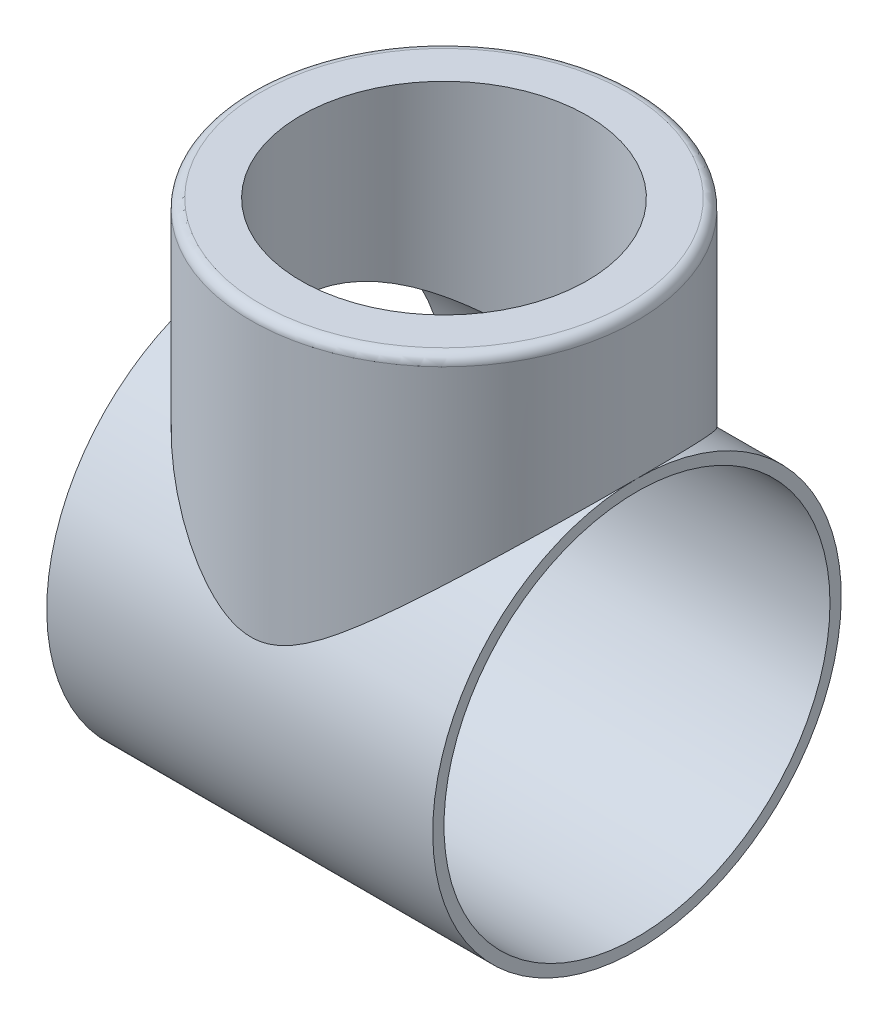
ISO-10303-21;
HEADER;
FILE_DESCRIPTION(('STEP AP214'),'2;1');
FILE_NAME('part.step','',(''),(''),'','','');
FILE_SCHEMA(('AUTOMOTIVE_DESIGN { 1 0 10303 214 1 1 1 1 }'));
ENDSEC;
DATA;
#1=APPLICATION_CONTEXT('core data for automotive mechanical design processes');
#2=APPLICATION_PROTOCOL_DEFINITION('international standard','automotive_design',2000,#1);
#3=PRODUCT_CONTEXT('',#1,'mechanical');
#4=PRODUCT('Part','Part','',(#3));
#5=PRODUCT_RELATED_PRODUCT_CATEGORY('part','',(#4));
#6=PRODUCT_DEFINITION_FORMATION('','',#4);
#7=PRODUCT_DEFINITION_CONTEXT('part definition',#1,'design');
#8=PRODUCT_DEFINITION('design','',#6,#7);
#9=PRODUCT_DEFINITION_SHAPE('','',#8);
#10=(LENGTH_UNIT() NAMED_UNIT(*) SI_UNIT(.MILLI.,.METRE.));
#11=(NAMED_UNIT(*) PLANE_ANGLE_UNIT() SI_UNIT($,.RADIAN.));
#12=(NAMED_UNIT(*) SI_UNIT($,.STERADIAN.) SOLID_ANGLE_UNIT());
#13=UNCERTAINTY_MEASURE_WITH_UNIT(LENGTH_MEASURE(1.E-05),#10,'distance_accuracy_value','');
#14=(GEOMETRIC_REPRESENTATION_CONTEXT(3) GLOBAL_UNCERTAINTY_ASSIGNED_CONTEXT((#13)) GLOBAL_UNIT_ASSIGNED_CONTEXT((#10,
#11,#12)) REPRESENTATION_CONTEXT('',''));
#15=CARTESIAN_POINT('',(0.,0.,0.));
#16=DIRECTION('',(0.,0.,1.));
#17=DIRECTION('',(1.,0.,0.));
#18=AXIS2_PLACEMENT_3D('',#15,#16,#17);
#19=CARTESIAN_POINT('',(-60.,0.,0.));
#20=DIRECTION('',(1.,0.,0.));
#21=DIRECTION('',(0.,0.,-1.));
#22=AXIS2_PLACEMENT_3D('',#19,#20,#21);
#23=CYLINDRICAL_SURFACE('',#22,60.);
#24=CARTESIAN_POINT('',(60.,0.,0.));
#25=DIRECTION('',(1.,0.,0.));
#26=DIRECTION('',(0.,0.,-1.));
#27=AXIS2_PLACEMENT_3D('',#24,#25,#26);
#28=CIRCLE('',#27,60.);
#29=CARTESIAN_POINT('',(60.,0.,-60.));
#30=VERTEX_POINT('',#29);
#31=EDGE_CURVE('E59',#30,#30,#28,.T.);
#32=ORIENTED_EDGE('',*,*,#31,.T.);
#33=EDGE_LOOP('',(#32));
#34=FACE_BOUND('',#33,.T.);
#35=CARTESIAN_POINT('',(-60.,0.,0.));
#36=DIRECTION('',(1.,0.,0.));
#37=DIRECTION('',(0.,0.,-1.));
#38=AXIS2_PLACEMENT_3D('',#35,#36,#37);
#39=CIRCLE('',#38,60.);
#40=CARTESIAN_POINT('',(-60.,0.,-60.));
#41=VERTEX_POINT('',#40);
#42=EDGE_CURVE('E100',#41,#41,#39,.T.);
#43=ORIENTED_EDGE('',*,*,#42,.F.);
#44=EDGE_LOOP('',(#43));
#45=FACE_BOUND('',#44,.T.);
#46=CARTESIAN_POINT('',(0.,40.2461178252015,-44.5));
#47=CARTESIAN_POINT('',(0.521950340710105,40.2461091874401,-44.5000042882494));
#48=CARTESIAN_POINT('',(1.04383948497891,40.2562813467974,-44.4908134860222));
#49=CARTESIAN_POINT('',(2.08624468800879,40.29679076695,-44.4541277588759));
#50=CARTESIAN_POINT('',(2.60676066855394,40.3271291525426,-44.4266318129637));
#51=CARTESIAN_POINT('',(3.64504853630487,40.4075295655595,-44.353517329002));
#52=CARTESIAN_POINT('',(4.16282007227801,40.4575940585679,-44.3078965255041));
#53=CARTESIAN_POINT('',(5.19431452475009,40.5766947814115,-44.1988491619566));
#54=CARTESIAN_POINT('',(5.70803686242041,40.6457336747779,-44.1354201020462));
#55=CARTESIAN_POINT('',(7.24359513295137,40.8802693471307,-43.9186705620038));
#56=CARTESIAN_POINT('',(8.25776608674282,41.0730198952663,-43.7390345051422));
#57=CARTESIAN_POINT('',(10.257564643931,41.5212745320888,-43.3137226483211));
#58=CARTESIAN_POINT('',(11.2431912015059,41.7767809168073,-43.068044432063));
#59=CARTESIAN_POINT('',(13.1683910438996,42.3357936145265,-42.5186066248349));
#60=CARTESIAN_POINT('',(14.1084079437203,42.6386010337178,-42.2156810096681));
#61=CARTESIAN_POINT('',(15.9539269275721,43.2842945061565,-41.5533826240879));
#62=CARTESIAN_POINT('',(16.8594298899541,43.627179538558,-41.1940112913641));
#63=CARTESIAN_POINT('',(18.6345171116782,44.3433852758225,-40.4220393745185));
#64=CARTESIAN_POINT('',(19.5041118289542,44.7166970236494,-40.009454434771));
#65=CARTESIAN_POINT('',(21.2071478906121,45.4853354810806,-39.1334121551078));
#66=CARTESIAN_POINT('',(22.0405865870086,45.8806637983028,-38.6699510978862));
#67=CARTESIAN_POINT('',(23.8366942513597,46.767617311318,-37.5948011891203));
#68=CARTESIAN_POINT('',(24.7912022086411,47.2624844601025,-36.9721303467494));
#69=CARTESIAN_POINT('',(26.6465675245206,48.261565680328,-35.6581377576236));
#70=CARTESIAN_POINT('',(27.5474205383753,48.7657805043797,-34.9668104634265));
#71=CARTESIAN_POINT('',(29.2952372557201,49.7739969690618,-33.5161235927462));
#72=CARTESIAN_POINT('',(30.1421256550589,50.2779973773472,-32.756672361943));
#73=CARTESIAN_POINT('',(31.778415864999,51.275700055055,-31.1717762181585));
#74=CARTESIAN_POINT('',(32.5678130326399,51.7694014904457,-30.346325986402));
#75=CARTESIAN_POINT('',(34.2360957924212,52.8334127397948,-28.4608944512654));
#76=CARTESIAN_POINT('',(35.1017938682631,53.3995579491807,-27.3868198685674));
#77=CARTESIAN_POINT('',(36.7388816469887,54.4896567975256,-25.1480955787368));
#78=CARTESIAN_POINT('',(37.5102508272926,55.0136012466809,-23.9834262512978));
#79=CARTESIAN_POINT('',(38.5884296851264,55.7561611927072,-22.1737546625714));
#80=CARTESIAN_POINT('',(38.9344445874246,55.996289592825,-21.5605741567996));
#81=CARTESIAN_POINT('',(39.5992657729467,56.4605628572466,-20.3137179214327));
#82=CARTESIAN_POINT('',(39.9180737273749,56.6847087031497,-19.6800434539945));
#83=CARTESIAN_POINT('',(40.5269396885394,57.1151163559301,-18.3935670488333));
#84=CARTESIAN_POINT('',(40.8170136671901,57.3213880901394,-17.7407760015974));
#85=CARTESIAN_POINT('',(41.367283893526,57.7145139820236,-16.4168180955821));
#86=CARTESIAN_POINT('',(41.6274729718284,57.9013634792897,-15.7456468750289));
#87=CARTESIAN_POINT('',(42.2160536104265,58.3257078564334,-14.1098261539199));
#88=CARTESIAN_POINT('',(42.5291096534308,58.5528683078576,-13.1368990351965));
#89=CARTESIAN_POINT('',(43.0893465453492,58.9610459401474,-11.1628943464204));
#90=CARTESIAN_POINT('',(43.336542803193,59.1420739139977,-10.1618234217544));
#91=CARTESIAN_POINT('',(43.6554372000947,59.3762755689208,-8.6440871772517));
#92=CARTESIAN_POINT('',(43.7530730054295,59.4481102596546,-8.13557560487839));
#93=CARTESIAN_POINT('',(43.9307501982228,59.5789994743003,-7.11392105689515));
#94=CARTESIAN_POINT('',(44.0107948440874,59.6380563650094,-6.60077895735988));
#95=CARTESIAN_POINT('',(44.1530120978249,59.7430847523843,-5.57062792558039));
#96=CARTESIAN_POINT('',(44.2151826797549,59.7890547657069,-5.05361856180834));
#97=CARTESIAN_POINT('',(44.3214117367221,59.8676564997752,-4.01674246446689));
#98=CARTESIAN_POINT('',(44.3654693389796,59.9002875777797,-3.49687559443048));
#99=CARTESIAN_POINT('',(44.4703501236668,59.9779923563319,-1.9318670440071));
#100=CARTESIAN_POINT('',(44.5035602840376,60.0026399674937,-0.88363602968756));
#101=CARTESIAN_POINT('',(44.4958330595716,59.9969100963708,1.21224592845824));
#102=CARTESIAN_POINT('',(44.4548959647422,59.9665328293014,2.25989687453725));
#103=CARTESIAN_POINT('',(44.2995376296408,59.8514519760434,4.34695695359885));
#104=CARTESIAN_POINT('',(44.1851013218437,59.7667372505429,5.38636435239261));
#105=CARTESIAN_POINT('',(43.8844904701222,59.5448422310987,7.44901649884121));
#106=CARTESIAN_POINT('',(43.6983163060761,59.4076622149783,8.47226133205295));
#107=CARTESIAN_POINT('',(43.2641008547636,59.0890127256266,10.4628678346911));
#108=CARTESIAN_POINT('',(43.01826041709,58.9091228962178,11.4309658277476));
#109=CARTESIAN_POINT('',(42.4650233393857,58.5063437246237,13.3401503805873));
#110=CARTESIAN_POINT('',(42.1576284675576,58.2834556176068,14.2812377153866));
#111=CARTESIAN_POINT('',(41.4846675568433,57.7985571326788,16.1320211676757));
#112=CARTESIAN_POINT('',(41.1190966396067,57.5365434740096,17.0417146448432));
#113=CARTESIAN_POINT('',(40.3333455968536,56.9776492982644,18.8260933971558));
#114=CARTESIAN_POINT('',(39.9131622370173,56.6807667162419,19.7007765948666));
#115=CARTESIAN_POINT('',(38.973005458837,56.022499557773,21.5058204330082));
#116=CARTESIAN_POINT('',(38.447145875456,55.6576115664077,22.4318370619908));
#117=CARTESIAN_POINT('',(37.3370135215526,54.8966231580356,24.2346518194598));
#118=CARTESIAN_POINT('',(36.7527371551884,54.5005208199496,25.1114469129235));
#119=CARTESIAN_POINT('',(35.5293085248845,53.6830922067384,26.8145183935474));
#120=CARTESIAN_POINT('',(34.8901161360653,53.2617475573133,27.6407570734165));
#121=CARTESIAN_POINT('',(33.5606121215878,52.4004604406604,29.2406792745826));
#122=CARTESIAN_POINT('',(32.870298061972,51.9605170883568,30.0143602901862));
#123=CARTESIAN_POINT('',(31.3024484369485,50.9818427894829,31.6532889949493));
#124=CARTESIAN_POINT('',(30.4145893453604,50.4405197225372,32.5071389666396));
#125=CARTESIAN_POINT('',(28.5731712452284,49.3520446269879,34.1370213226318));
#126=CARTESIAN_POINT('',(27.6195994067465,48.8048914778322,34.9130384375959));
#127=CARTESIAN_POINT('',(25.6486318538073,47.7171498458324,36.3855978659591));
#128=CARTESIAN_POINT('',(24.6312091197479,47.1765642592419,37.0821061775823));
#129=CARTESIAN_POINT('',(22.5342509045028,46.116418432799,38.3925212205582));
#130=CARTESIAN_POINT('',(21.4547302842137,45.5968532127562,39.006447598487));
#131=CARTESIAN_POINT('',(19.4624345702153,44.6980671169939,40.0305783513116));
#132=CARTESIAN_POINT('',(18.5609538061182,44.3119394783666,40.456726223778));
#133=CARTESIAN_POINT('',(16.7197604126817,43.572807752645,41.2517262412505));
#134=CARTESIAN_POINT('',(15.7800487337206,43.2198028428767,41.6205798094328));
#135=CARTESIAN_POINT('',(13.8656151236316,42.5581977274057,42.296847572139));
#136=CARTESIAN_POINT('',(12.8909619150813,42.249515755869,42.6043753175112));
#137=CARTESIAN_POINT('',(10.9079654832495,41.6872994375876,43.1546536827896));
#138=CARTESIAN_POINT('',(9.89963037601222,41.4337519145739,43.3974197828659));
#139=CARTESIAN_POINT('',(8.04368455823555,41.0339903275956,43.7752515698321));
#140=CARTESIAN_POINT('',(7.20084207288908,40.8765977494339,43.9219324868934));
#141=CARTESIAN_POINT('',(5.50041819802821,40.6115732475786,44.1671019477012));
#142=CARTESIAN_POINT('',(4.64283865424277,40.5039351388694,44.2655964816223));
#143=CARTESIAN_POINT('',(2.91911830773351,40.3427295547646,44.4125677286822));
#144=CARTESIAN_POINT('',(2.05298633650212,40.2891112096413,44.4610914996129));
#145=CARTESIAN_POINT('',(0.317674362643003,40.2380272726962,44.5073296836804));
#146=CARTESIAN_POINT('',(-0.55150568599144,40.2405625321182,44.505043326576));
#147=CARTESIAN_POINT('',(-2.28596227436666,40.3016700196146,44.4497135761221));
#148=CARTESIAN_POINT('',(-3.15123997960492,40.3602242255133,44.3966865068562));
#149=CARTESIAN_POINT('',(-4.87190451576451,40.5308806498048,44.240941803076));
#150=CARTESIAN_POINT('',(-5.72729134396141,40.642982882947,44.1382241548749));
#151=CARTESIAN_POINT('',(-7.4240653876941,40.9165547676885,43.8847377234221));
#152=CARTESIAN_POINT('',(-8.26543150123807,41.0780927929654,43.7339023771944));
#153=CARTESIAN_POINT('',(-9.92893795590823,41.4448438963211,43.3865023518875));
#154=CARTESIAN_POINT('',(-10.7510755777273,41.6500631108678,43.1899312473468));
#155=CARTESIAN_POINT('',(-12.6870807095658,42.1846332622747,42.6690124944642));
#156=CARTESIAN_POINT('',(-13.7908179644599,42.5312978618984,42.3246484503561));
#157=CARTESIAN_POINT('',(-15.9516144607349,43.2801948728189,41.5585305214342));
#158=CARTESIAN_POINT('',(-17.0086544471686,43.6824499289662,41.1367450758049));
#159=CARTESIAN_POINT('',(-19.0755684632273,44.527930076714,40.2200546403792));
#160=CARTESIAN_POINT('',(-20.0853647652594,44.9712193419744,39.7250343695755));
#161=CARTESIAN_POINT('',(-22.0550882608731,45.884808424398,38.6661782679115));
#162=CARTESIAN_POINT('',(-23.0150204412288,46.355105530638,38.1023493373789));
#163=CARTESIAN_POINT('',(-24.9161621372768,47.3273236161702,36.8883376618597));
#164=CARTESIAN_POINT('',(-25.8556469650214,47.8297762042605,36.2358830733489));
#165=CARTESIAN_POINT('',(-27.679910014823,48.8400529111134,34.8622472738526));
#166=CARTESIAN_POINT('',(-28.5646860737176,49.3478772413438,34.1410633481983));
#167=CARTESIAN_POINT('',(-30.2772938766035,50.358584957203,32.6318457992776));
#168=CARTESIAN_POINT('',(-31.1051561867018,50.8614708686789,31.8438485747471));
#169=CARTESIAN_POINT('',(-32.7017712726705,51.853299207555,30.2019087999941));
#170=CARTESIAN_POINT('',(-33.470525540107,52.3422419866083,29.3479679149222));
#171=CARTESIAN_POINT('',(-34.9471366600719,53.2985479551122,27.5732364539518));
#172=CARTESIAN_POINT('',(-35.6548356260329,53.7658538285782,26.6522832808933));
#173=CARTESIAN_POINT('',(-37.0025002306692,54.6688659515999,24.7472453764052));
#174=CARTESIAN_POINT('',(-37.6424632932466,55.1045709991306,23.7631582461808));
#175=CARTESIAN_POINT('',(-38.8486279933934,55.9354535238626,21.7353357344004));
#176=CARTESIAN_POINT('',(-39.4148771427242,56.3306570707044,20.6916394040002));
#177=CARTESIAN_POINT('',(-40.4677394262983,57.0723077490861,18.5482327967657));
#178=CARTESIAN_POINT('',(-40.954366559355,57.4187634497671,17.4485324110101));
#179=CARTESIAN_POINT('',(-41.7734480273411,58.0060562896384,15.3713226943041));
#180=CARTESIAN_POINT('',(-42.1180999819418,58.2549428335656,14.4008872247955));
#181=CARTESIAN_POINT('',(-42.7416054367343,58.7073143426455,12.4287679411175));
#182=CARTESIAN_POINT('',(-43.0204651989122,58.9108036285294,11.4270871111101));
#183=CARTESIAN_POINT('',(-43.5086322607101,59.2682330369469,9.39874524150024));
#184=CARTESIAN_POINT('',(-43.7179750064187,59.4221984100089,8.37209721993441));
#185=CARTESIAN_POINT('',(-44.0642873146111,59.6774471738407,6.30013580032234));
#186=CARTESIAN_POINT('',(-44.2012560659236,59.7787299741415,5.25482219320709));
#187=CARTESIAN_POINT('',(-44.4009995850255,59.9265736105224,3.14995644098688));
#188=CARTESIAN_POINT('',(-44.4635423875705,59.9729633575138,2.09037013500847));
#189=CARTESIAN_POINT('',(-44.5126410521356,60.0093737571475,-0.0315402479794816));
#190=CARTESIAN_POINT('',(-44.49919675987,59.9993942953369,-1.09386433054349));
#191=CARTESIAN_POINT('',(-44.3965384869147,59.9232964064283,-3.21290418427762));
#192=CARTESIAN_POINT('',(-44.3073172142214,59.8571725765695,-4.26961940586038));
#193=CARTESIAN_POINT('',(-44.0545293478902,59.6702967677894,-6.36918090875246));
#194=CARTESIAN_POINT('',(-43.8909640703089,59.5495457558927,-7.41202743523263));
#195=CARTESIAN_POINT('',(-43.5013980468378,59.2630163329123,-9.42773117519935));
#196=CARTESIAN_POINT('',(-43.2786998341044,59.0996258396571,-10.4015717985618));
#197=CARTESIAN_POINT('',(-42.7709367825483,58.7288085972727,-12.3241853536313));
#198=CARTESIAN_POINT('',(-42.4858743947813,58.5213835788113,-13.2729592688756));
#199=CARTESIAN_POINT('',(-41.8566393162162,58.0661784465417,-15.1407765123869));
#200=CARTESIAN_POINT('',(-41.5124612489804,57.818394662301,-16.0598171274347));
#201=CARTESIAN_POINT('',(-40.7685039846635,57.2865888952406,-17.864256334358));
#202=CARTESIAN_POINT('',(-40.3687215084379,57.0025647753105,-18.7496529382301));
#203=CARTESIAN_POINT('',(-39.4756743282588,56.373476215924,-20.5680435948418));
#204=CARTESIAN_POINT('',(-38.9771009809435,56.0251623487047,-21.4973049359076));
#205=CARTESIAN_POINT('',(-37.9216627541991,55.2960838893367,-23.3087229625223));
#206=CARTESIAN_POINT('',(-37.3647947388914,54.9153175516585,-24.1908771101481));
#207=CARTESIAN_POINT('',(-36.196421767278,54.1271171877636,-25.9065023282224));
#208=CARTESIAN_POINT('',(-35.5848840858751,53.7196672283635,-26.7399437390662));
#209=CARTESIAN_POINT('',(-34.3109233963292,52.8843847752664,-28.3561187012408));
#210=CARTESIAN_POINT('',(-33.6484978667809,52.4565512719992,-29.1388497364131));
#211=CARTESIAN_POINT('',(-32.1442957713006,51.5034469314094,-30.797337438415));
#212=CARTESIAN_POINT('',(-31.2924453848203,50.9751879296599,-31.6622617350211));
#213=CARTESIAN_POINT('',(-29.5241829089023,49.9092126334412,-33.3172559849402));
#214=CARTESIAN_POINT('',(-28.6077594512591,49.3714946862736,-34.1073126999826));
#215=CARTESIAN_POINT('',(-26.7122623392538,48.297870061859,-35.6113733885586));
#216=CARTESIAN_POINT('',(-25.7331462834457,47.7619648741604,-36.3253250006942));
#217=CARTESIAN_POINT('',(-23.7143783853228,46.7052659315094,-37.6742851619448));
#218=CARTESIAN_POINT('',(-22.6747375816564,46.184469446795,-38.3093080404504));
#219=CARTESIAN_POINT('',(-20.7074274646056,45.2539753190545,-39.4018648234355));
#220=CARTESIAN_POINT('',(-19.7885739385137,44.8398636275907,-39.8715266699809));
#221=CARTESIAN_POINT('',(-17.9091303612557,44.0427382109742,-40.7503257680393));
#222=CARTESIAN_POINT('',(-16.9485395648822,43.6597250414274,-41.1594619383084));
#223=CARTESIAN_POINT('',(-14.9886766513092,42.9369595143049,-41.9128813803387));
#224=CARTESIAN_POINT('',(-13.9894816994186,42.5971261433523,-42.2572866992272));
#225=CARTESIAN_POINT('',(-11.9533246844578,41.972544556354,-42.877728409414));
#226=CARTESIAN_POINT('',(-10.9163746735275,41.6877789416741,-43.1537864027726));
#227=CARTESIAN_POINT('',(-9.06795056486468,41.2478015067845,-43.5739296071159));
#228=CARTESIAN_POINT('',(-8.26352200117434,41.0779436302794,-43.7337772467831));
#229=CARTESIAN_POINT('',(-6.63919931287222,40.7822487862483,-44.0096492737428));
#230=CARTESIAN_POINT('',(-5.8193077359748,40.6564046325783,-44.1256808151597));
#231=CARTESIAN_POINT('',(-4.16918296146037,40.4532122182416,-44.3120376887577));
#232=CARTESIAN_POINT('',(-3.33896078214854,40.375816164653,-44.3824080671271));
#233=CARTESIAN_POINT('',(-1.6724406360641,40.2722721227382,-44.4763892223377));
#234=CARTESIAN_POINT('',(-0.836141794890599,40.2461316625205,-44.4999931304106));
#235=CARTESIAN_POINT('',(0.,40.2461178252015,-44.5));
#236=B_SPLINE_CURVE_WITH_KNOTS('',3,(#46,#47,#48,#49,#50,#51,#52,#53,#54,#55,#56,#57,#58,#59,
#60,#61,#62,#63,#64,#65,#66,#67,#68,#69,#70,#71,#72,#73,#74,#75,#76,#77,#78,#79,#80,#81,#82,#83,
#84,#85,#86,#87,#88,#89,#90,#91,#92,#93,#94,#95,#96,#97,#98,#99,#100,#101,#102,#103,#104,#105,
#106,#107,#108,#109,#110,#111,#112,#113,#114,#115,#116,#117,#118,#119,#120,#121,#122,#123,#124,
#125,#126,#127,#128,#129,#130,#131,#132,#133,#134,#135,#136,#137,#138,#139,#140,#141,#142,#143,
#144,#145,#146,#147,#148,#149,#150,#151,#152,#153,#154,#155,#156,#157,#158,#159,#160,#161,#162,
#163,#164,#165,#166,#167,#168,#169,#170,#171,#172,#173,#174,#175,#176,#177,#178,#179,#180,#181,
#182,#183,#184,#185,#186,#187,#188,#189,#190,#191,#192,#193,#194,#195,#196,#197,#198,#199,#200,
#201,#202,#203,#204,#205,#206,#207,#208,#209,#210,#211,#212,#213,#214,#215,#216,#217,#218,#219,
#220,#221,#222,#223,#224,#225,#226,#227,#228,#229,#230,#231,#232,#233,#234,#235),.UNSPECIFIED.,
.T.,.F.,(4,2,2,2,2,2,2,2,2,2,2,2,2,2,2,2,2,2,2,2,2,2,2,2,2,2,2,2,2,2,2,2,2,2,2,2,2,2,2,2,2,2,2,
2,2,2,2,2,2,2,2,2,2,2,2,2,2,2,2,2,2,2,2,2,2,2,2,2,2,2,2,2,2,2,2,2,2,2,2,2,2,2,2,2,2,2,2,2,2,2,2,
2,2,2,4),(0.,1.56556517147146,3.13121767169813,4.69706592637481,6.26313409934394,
9.40144702949159,12.5398747973961,15.6356864170503,18.7314191982175,21.826243924496,
24.9212949274269,28.6453743115329,32.3697548465043,36.099223572733,39.8289931555986,
44.2965662154786,48.7651095360273,50.9960052618935,53.2267638547709,55.4562754288435,
57.6863207501565,60.823899258746,63.9607430356961,65.5286258562801,67.0962180130722,
68.6639877792385,70.2318330800318,73.3745578864826,76.5172704010164,79.660627385307,
82.8039677245902,85.8454248664966,88.8867946525303,91.9284196070492,94.9702247782702,
98.3440535849777,101.718090195545,105.09461339013,108.471297448081,112.503760025058,
116.53701215405,120.57198268409,124.605991574121,127.81141806161,131.016764914371,
134.216120486931,137.4147106213,140.021682558505,142.62833033385,145.23252116116,
147.836751465953,150.440144230556,153.04353771224,155.650548295344,158.257925361325,
161.873592564132,165.490736979422,169.113637051068,172.736174106099,176.48094468703,
180.225863240111,183.968754575554,187.71155142972,191.463753733026,195.216098686979,
198.966012991889,202.715267292296,205.890427517031,209.065285413528,212.238521984498,
215.411794120498,218.594930785149,221.778073912902,224.961523388583,228.144916512222,
231.17841403459,234.211792354927,237.245446700401,240.279280024709,243.607858112388,
246.936615348285,250.267378683901,253.598307159686,257.566177425562,261.534747995964,
265.506031612056,269.476593191306,272.809775718956,276.14301778413,279.46991070141,
282.795750764736,285.306240089339,287.816319333457,290.323918524506,292.831885988828),.UNSPECIFIED.);
#237=CARTESIAN_POINT('',(0.,40.2461178252015,-44.5));
#238=VERTEX_POINT('',#237);
#239=EDGE_CURVE('E21',#238,#238,#236,.T.);
#240=ORIENTED_EDGE('',*,*,#239,.F.);
#241=EDGE_LOOP('',(#240));
#242=FACE_BOUND('',#241,.T.);
#243=ADVANCED_FACE('F16',(#34,#45,#242),#23,.F.);
#244=CARTESIAN_POINT('',(0.,0.,0.));
#245=DIRECTION('',(0.,-1.,0.));
#246=DIRECTION('',(0.,0.,-1.));
#247=AXIS2_PLACEMENT_3D('',#244,#245,#246);
#248=CYLINDRICAL_SURFACE('',#247,60.);
#249=CARTESIAN_POINT('',(0.,106.,0.));
#250=DIRECTION('',(0.,-1.,0.));
#251=DIRECTION('',(0.,0.,-1.));
#252=AXIS2_PLACEMENT_3D('',#249,#250,#251);
#253=CIRCLE('',#252,60.);
#254=CARTESIAN_POINT('',(0.,106.,-60.));
#255=VERTEX_POINT('',#254);
#256=EDGE_CURVE('E11',#255,#255,#253,.T.);
#257=ORIENTED_EDGE('',*,*,#256,.T.);
#258=EDGE_LOOP('',(#257));
#259=FACE_BOUND('',#258,.T.);
#260=CARTESIAN_POINT('',(0.,20.7906228862918,-60.));
#261=CARTESIAN_POINT('',(0.758528909390587,20.7906687322399,-59.9999904065511));
#262=CARTESIAN_POINT('',(1.51729366262084,20.8324790088875,-59.98554699321));
#263=CARTESIAN_POINT('',(3.02541119739763,20.9961734248151,-59.9284381571005));
#264=CARTESIAN_POINT('',(3.77475470966428,21.1181309601118,-59.8857468656814));
#265=CARTESIAN_POINT('',(5.26008636130046,21.4333476508569,-59.7736517022794));
#266=CARTESIAN_POINT('',(5.99598309437329,21.6269798770012,-59.7041079787402));
#267=CARTESIAN_POINT('',(7.44660432062503,22.0731706531462,-59.5405851678695));
#268=CARTESIAN_POINT('',(8.16132786930634,22.3257318274138,-59.4466049922948));
#269=CARTESIAN_POINT('',(9.41850242889429,22.8188288099898,-59.2587975120337));
#270=CARTESIAN_POINT('',(9.96516431764428,23.0504265040595,-59.1692185698772));
#271=CARTESIAN_POINT('',(11.0454442017346,23.5376156349974,-58.9771073554713));
#272=CARTESIAN_POINT('',(11.5790596845841,23.7932116483219,-58.8745726112687));
#273=CARTESIAN_POINT('',(12.6342055594526,24.3241678903389,-58.6572009071734));
#274=CARTESIAN_POINT('',(13.1557274926231,24.5995414317841,-58.5423556346522));
#275=CARTESIAN_POINT('',(14.1871816507752,25.166256868166,-58.3009810156804));
#276=CARTESIAN_POINT('',(14.6971145190673,25.4575978736686,-58.1744523197619));
#277=CARTESIAN_POINT('',(15.7078218450643,26.0541498508793,-57.9097406057808));
#278=CARTESIAN_POINT('',(16.2085648488496,26.3593992025115,-57.7715243095543));
#279=CARTESIAN_POINT('',(17.2002231418555,26.980521261027,-57.4840737539756));
#280=CARTESIAN_POINT('',(17.6911376592914,27.2963947969985,-57.3348386336471));
#281=CARTESIAN_POINT('',(19.1499499190291,28.2565531409301,-56.8710945910735));
#282=CARTESIAN_POINT('',(20.1043443165854,28.9136328016263,-56.5404340934388));
#283=CARTESIAN_POINT('',(22.0039769964669,30.2649996523406,-55.8290004142343));
#284=CARTESIAN_POINT('',(22.9484730965435,30.9597983411099,-55.4472322243461));
#285=CARTESIAN_POINT('',(24.8087273501631,32.3627900030287,-54.640232118589));
#286=CARTESIAN_POINT('',(25.7244808693601,33.0709851069629,-54.2149932402454));
#287=CARTESIAN_POINT('',(27.5301587030445,34.4942177445593,-53.3207838963083));
#288=CARTESIAN_POINT('',(28.4200632243271,35.2092599917402,-52.8517810198544));
#289=CARTESIAN_POINT('',(30.1746375527395,36.6401586498467,-51.8700459354968));
#290=CARTESIAN_POINT('',(31.0393088329444,37.3560150107006,-51.3573162871723));
#291=CARTESIAN_POINT('',(32.7428121268253,38.7830613774666,-50.2883478998282));
#292=CARTESIAN_POINT('',(33.5816780939988,39.4942564530126,-49.7321700686894));
#293=CARTESIAN_POINT('',(35.234669982534,40.9090380230505,-48.5750536608696));
#294=CARTESIAN_POINT('',(36.0487951337687,41.6126242802584,-47.9741136928473));
#295=CARTESIAN_POINT('',(37.6510954118819,43.0081407004995,-46.7271330486956));
#296=CARTESIAN_POINT('',(38.4392848277944,43.7000771756526,-46.0811178399591));
#297=CARTESIAN_POINT('',(39.9888399141275,45.0691221589826,-44.7430488200409));
#298=CARTESIAN_POINT('',(40.7502076319229,45.7462317974337,-44.0509985345428));
#299=CARTESIAN_POINT('',(42.5829204522391,47.3847886646905,-42.2960309164036));
#300=CARTESIAN_POINT('',(43.6385274405875,48.3361625708875,-41.2070707142414));
#301=CARTESIAN_POINT('',(45.6828552063846,50.1895163052427,-38.9283808789139));
#302=CARTESIAN_POINT('',(46.6715760592437,51.0914961890899,-37.7386513593641));
#303=CARTESIAN_POINT('',(48.0968489136662,52.397719369308,-35.8789928350597));
#304=CARTESIAN_POINT('',(48.5620560600246,52.8251053584278,-35.2469780635364));
#305=CARTESIAN_POINT('',(49.4722030615757,53.6629970827709,-33.9576752372917));
#306=CARTESIAN_POINT('',(49.9171443182551,54.0735039850751,-33.3003889360368));
#307=CARTESIAN_POINT('',(50.785239676417,54.8758885887138,-31.9608542168824));
#308=CARTESIAN_POINT('',(51.2084000426182,55.2677716442079,-31.2786130742796));
#309=CARTESIAN_POINT('',(52.0316481010739,56.0314086794391,-29.8891272744113));
#310=CARTESIAN_POINT('',(52.4317299163567,56.4031575305253,-29.1818763216913));
#311=CARTESIAN_POINT('',(53.4326006917372,57.3344775183045,-27.3244873901495));
#312=CARTESIAN_POINT('',(54.0148396806077,57.8775849365436,-26.1559284749153));
#313=CARTESIAN_POINT('',(55.1104563481879,58.9013953354424,-23.7606996871457));
#314=CARTESIAN_POINT('',(55.623849737572,59.3821125528359,-22.5340431593334));
#315=CARTESIAN_POINT('',(56.3369569822265,60.0507779860611,-20.6542203035782));
#316=CARTESIAN_POINT('',(56.5651646691798,60.2649336682026,-20.0209651192068));
#317=CARTESIAN_POINT('',(57.001741284094,60.6748948739397,-18.7418762661228));
#318=CARTESIAN_POINT('',(57.2101134658845,60.8707034071312,-18.0960446814612));
#319=CARTESIAN_POINT('',(57.6062016973035,61.2431214762665,-16.7925461809546));
#320=CARTESIAN_POINT('',(57.7939157959858,61.4197291988699,-16.1348781540904));
#321=CARTESIAN_POINT('',(58.1478526247792,61.7528881498504,-14.8087211107725));
#322=CARTESIAN_POINT('',(58.3140744128745,61.9094384991028,-14.1402316214542));
#323=CARTESIAN_POINT('',(58.6254299614442,62.2027997497841,-12.7884212341209));
#324=CARTESIAN_POINT('',(58.7703922744052,62.3394501114345,-12.1050259204838));
#325=CARTESIAN_POINT('',(59.0369866822571,62.5908445998107,-10.7296289567849));
#326=CARTESIAN_POINT('',(59.1586165304059,62.7055866169215,-10.037626484743));
#327=CARTESIAN_POINT('',(59.3778914230342,62.9125001293602,-8.64649196407175));
#328=CARTESIAN_POINT('',(59.475537005446,63.0046721309006,-7.9473600757112));
#329=CARTESIAN_POINT('',(59.6463168139495,63.165911038749,-6.54346262801519));
#330=CARTESIAN_POINT('',(59.7194513133625,63.2349782026974,-5.83869713158943));
#331=CARTESIAN_POINT('',(59.8407758047187,63.3495702561386,-4.42541956584605));
#332=CARTESIAN_POINT('',(59.8889765473168,63.3951052919398,-3.716909244522));
#333=CARTESIAN_POINT('',(59.9602033516643,63.4623971368019,-2.29757972319877));
#334=CARTESIAN_POINT('',(59.9832322842367,63.4841566574395,-1.58676079577034));
#335=CARTESIAN_POINT('',(60.0039892025269,63.5037692257477,-0.164433052004176));
#336=CARTESIAN_POINT('',(60.0017179853667,63.5016230266065,0.547075741891947));
#337=CARTESIAN_POINT('',(59.9719010196848,63.4734503428098,1.96902100026199));
#338=CARTESIAN_POINT('',(59.9443559975306,63.4474245444525,2.67945749496598));
#339=CARTESIAN_POINT('',(59.8337650199722,63.3429462153451,4.63417148601373));
#340=CARTESIAN_POINT('',(59.7244990534306,63.2397297181741,5.87582573496755));
#341=CARTESIAN_POINT('',(59.4302796460327,62.9619393948515,8.34172373501794));
#342=CARTESIAN_POINT('',(59.2453336712804,62.7873726076638,9.56596919122999));
#343=CARTESIAN_POINT('',(58.8027968147367,62.3699728081123,11.989514771222));
#344=CARTESIAN_POINT('',(58.5451991013245,62.1271333759116,13.1888125377168));
#345=CARTESIAN_POINT('',(57.961305301611,61.5772140343237,15.5554813630102));
#346=CARTESIAN_POINT('',(57.6350054065378,61.2701305633253,16.722850647674));
#347=CARTESIAN_POINT('',(56.9088702964539,60.5875710834974,19.050065571891));
#348=CARTESIAN_POINT('',(56.507334178709,60.2105155945908,20.2089148761408));
#349=CARTESIAN_POINT('',(55.6419501166776,59.3991076301619,22.4822789702302));
#350=CARTESIAN_POINT('',(55.1781030216677,58.9647559355682,23.5967943640572));
#351=CARTESIAN_POINT('',(54.1933504392047,58.0442814595975,25.7781503739198));
#352=CARTESIAN_POINT('',(53.6724420871035,57.5581560790584,26.8449885926276));
#353=CARTESIAN_POINT('',(52.5785531216232,56.5394950047237,28.9288943388254));
#354=CARTESIAN_POINT('',(52.0055613586887,56.0069493746984,29.94595113752));
#355=CARTESIAN_POINT('',(50.9564836787026,55.0343933635614,31.6892273695647));
#356=CARTESIAN_POINT('',(50.4903989534606,54.6030819626321,32.4263828230759));
#357=CARTESIAN_POINT('',(49.5330968526136,53.7191212703474,33.870678097755));
#358=CARTESIAN_POINT('',(49.0418837011452,53.2664755663289,34.5778229274382));
#359=CARTESIAN_POINT('',(47.5326431796392,51.8791349918499,36.6548496992369));
#360=CARTESIAN_POINT('',(46.4792485157517,50.915253822379,37.9799383317709));
#361=CARTESIAN_POINT('',(44.2876354690731,48.9227510920271,40.5144742737073));
#362=CARTESIAN_POINT('',(43.1491544240426,47.8939307220679,41.7235347598777));
#363=CARTESIAN_POINT('',(40.799815617742,45.7886694310987,44.0235959738365));
#364=CARTESIAN_POINT('',(39.5889676055663,44.7122349295989,45.1146125487972));
#365=CARTESIAN_POINT('',(37.5566358288247,42.925635713006,46.8033174342971));
#366=CARTESIAN_POINT('',(36.7546948944416,42.225483667487,47.4355079174354));
#367=CARTESIAN_POINT('',(35.1253194151573,40.8150874837224,48.6543643005233));
#368=CARTESIAN_POINT('',(34.2978833639616,40.1048427505247,49.2410275034114));
#369=CARTESIAN_POINT('',(32.6175047511009,38.6775738556822,50.3698696624441));
#370=CARTESIAN_POINT('',(31.7645426975343,37.9605448147293,50.9120133759927));
#371=CARTESIAN_POINT('',(30.0336692030098,36.5244804865607,51.9518821652084));
#372=CARTESIAN_POINT('',(29.155758762104,35.8054452808009,52.4496090180162));
#373=CARTESIAN_POINT('',(27.3763991281173,34.3720787220823,53.3998838019665));
#374=CARTESIAN_POINT('',(26.4750155378331,33.6577400546386,53.852543505548));
#375=CARTESIAN_POINT('',(24.6447075201963,32.237829488663,54.7143663452147));
#376=CARTESIAN_POINT('',(23.7157797059046,31.532258683524,55.1235241035372));
#377=CARTESIAN_POINT('',(21.8287917760074,30.138706864775,55.8976090636547));
#378=CARTESIAN_POINT('',(20.8707704289991,29.4507045136316,56.2625921516717));
#379=CARTESIAN_POINT('',(18.9203529914622,28.1021712098136,56.9481250825322));
#380=CARTESIAN_POINT('',(17.9279688275069,27.4416308974152,57.2686901524572));
#381=CARTESIAN_POINT('',(16.2347758220797,26.3731023134669,57.7662059172242));
#382=CARTESIAN_POINT('',(15.5451042326864,25.9533452186927,57.9557727293178));
#383=CARTESIAN_POINT('',(14.145000998825,25.1397301303381,58.3133016256247));
#384=CARTESIAN_POINT('',(13.4345684860103,24.7458732223051,58.4812628045688));
#385=CARTESIAN_POINT('',(11.9915601861318,23.993105210065,58.794105374896));
#386=CARTESIAN_POINT('',(11.2590148117499,23.6341487403093,58.9390168877664));
#387=CARTESIAN_POINT('',(9.76890030891742,22.9617010121501,59.2042300029197));
#388=CARTESIAN_POINT('',(9.01133819327823,22.6481971428825,59.3245384351666));
#389=CARTESIAN_POINT('',(7.66394620885365,22.1517197827822,59.5113698196047));
#390=CARTESIAN_POINT('',(7.07975187207299,21.9557353810002,59.583813090906));
#391=CARTESIAN_POINT('',(5.89778570076965,21.6036089820242,59.7123876813954));
#392=CARTESIAN_POINT('',(5.30001891891906,21.4474524144445,59.7685249669181));
#393=CARTESIAN_POINT('',(4.09422584327693,21.1817843970081,59.8631939386489));
#394=CARTESIAN_POINT('',(3.4862280029898,21.0721605455251,59.9017680659426));
#395=CARTESIAN_POINT('',(2.26220406470628,20.9045528992181,59.9604675581135));
#396=CARTESIAN_POINT('',(1.64617858093479,20.8465651767879,59.9805943261582));
#397=CARTESIAN_POINT('',(0.406796236364865,20.7853299263221,60.0018431849288));
#398=CARTESIAN_POINT('',(-0.21658193180487,20.782460444376,60.0028340260279));
#399=CARTESIAN_POINT('',(-1.46078189065839,20.8326035275548,59.985442278827));
#400=CARTESIAN_POINT('',(-2.08160363194148,20.8856171675315,59.9670593178927));
#401=CARTESIAN_POINT('',(-3.31671831080052,21.0445852806879,59.9114546959283));
#402=CARTESIAN_POINT('',(-3.93099594436179,21.1506440349662,59.8741959251749));
#403=CARTESIAN_POINT('',(-5.14799615984707,21.4102311635758,59.7818607643608));
#404=CARTESIAN_POINT('',(-5.7507166496707,21.5637680479414,59.7267811799951));
#405=CARTESIAN_POINT('',(-7.22135694427491,21.9931303830577,59.5703433546844));
#406=CARTESIAN_POINT('',(-8.08135503699839,22.2925568468197,59.459390890244));
#407=CARTESIAN_POINT('',(-9.76992230889682,22.9586099987819,59.2053970578338));
#408=CARTESIAN_POINT('',(-10.5984702437983,23.3252811683373,59.0623344353738));
#409=CARTESIAN_POINT('',(-12.2287783127481,24.1097614729603,58.746479888434));
#410=CARTESIAN_POINT('',(-13.0304255363341,24.5277583980892,58.5735777926153));
#411=CARTESIAN_POINT('',(-14.606629561452,25.4002579302588,58.2005340027037));
#412=CARTESIAN_POINT('',(-15.381190805212,25.8547545104959,58.000396801882));
#413=CARTESIAN_POINT('',(-17.0118428044231,26.8548428987068,57.5448468491374));
#414=CARTESIAN_POINT('',(-17.8644479805037,27.4043540722059,57.2856174903084));
#415=CARTESIAN_POINT('',(-19.543279473811,28.527194033868,56.7348277230435));
#416=CARTESIAN_POINT('',(-20.3694992682183,29.1005286321142,56.4432593984596));
#417=CARTESIAN_POINT('',(-21.9992618422014,30.2637023339719,55.8282333428868));
#418=CARTESIAN_POINT('',(-22.8027836810337,30.8535557389622,55.5047473265184));
#419=CARTESIAN_POINT('',(-24.3886372665535,32.0434251983279,54.8264349792148));
#420=CARTESIAN_POINT('',(-25.1709707940348,32.643440391713,54.4716112928341));
#421=CARTESIAN_POINT('',(-26.7172922178668,33.8501069518441,53.730090001806));
#422=CARTESIAN_POINT('',(-27.4812507569071,34.4567669411775,53.3433452676084));
#423=CARTESIAN_POINT('',(-28.9906404962924,35.6722178063826,52.5383127204357));
#424=CARTESIAN_POINT('',(-29.7360714479202,36.281008710735,52.1200244843195));
#425=CARTESIAN_POINT('',(-31.2086452758759,37.4974332369504,51.2518358260864));
#426=CARTESIAN_POINT('',(-31.9357955085427,38.1050672303482,50.8019484055169));
#427=CARTESIAN_POINT('',(-33.3722766591617,39.3167920231314,49.870072085474));
#428=CARTESIAN_POINT('',(-34.0816073882599,39.9208827849132,49.3880828459779));
#429=CARTESIAN_POINT('',(-35.562129203882,41.191683200239,48.3347883914542));
#430=CARTESIAN_POINT('',(-36.331151920835,41.8576791485035,47.7595654971656));
#431=CARTESIAN_POINT('',(-37.8461742604983,43.1792288351404,46.5681837635291));
#432=CARTESIAN_POINT('',(-38.5921734204128,43.834782363482,45.9520241020963));
#433=CARTESIAN_POINT('',(-40.0603124376432,45.132703448277,44.6779183477359));
#434=CARTESIAN_POINT('',(-40.782443206548,45.7750659474892,44.0199566101737));
#435=CARTESIAN_POINT('',(-42.201053362428,47.0433627335256,42.661871342333));
#436=CARTESIAN_POINT('',(-42.8975331462097,47.6692972744381,41.9617484647058));
#437=CARTESIAN_POINT('',(-44.2609049256129,48.8998143820474,40.5210175073272));
#438=CARTESIAN_POINT('',(-44.9278811753656,49.5044565887796,39.7805402872031));
#439=CARTESIAN_POINT('',(-46.2323436227258,50.6912847640404,38.2567162942638));
#440=CARTESIAN_POINT('',(-46.8698286547504,51.2734698448442,37.4733678297131));
#441=CARTESIAN_POINT('',(-48.1123681622239,52.4117157514376,35.864087050533));
#442=CARTESIAN_POINT('',(-48.7174420608969,52.9677921982708,35.0381808354609));
#443=CARTESIAN_POINT('',(-49.8925851930702,54.0506056360251,33.3435603311628));
#444=CARTESIAN_POINT('',(-50.4626596112058,54.5773469714132,32.474852416884));
#445=CARTESIAN_POINT('',(-51.6999340537438,55.7231195826794,30.476480117449));
#446=CARTESIAN_POINT('',(-52.3566644086509,56.3331017236956,29.3350678509573));
#447=CARTESIAN_POINT('',(-53.6041104557303,57.4943370151523,26.9882327473561));
#448=CARTESIAN_POINT('',(-54.1948377861362,58.0456005185765,25.782821250626));
#449=CARTESIAN_POINT('',(-55.3028391398836,59.0814298893703,23.3115648644228));
#450=CARTESIAN_POINT('',(-55.82014000171,59.5660201248308,22.0457422833469));
#451=CARTESIAN_POINT('',(-56.7739730326628,60.4607864226878,19.4580612763681));
#452=CARTESIAN_POINT('',(-57.2105026371027,60.8709601221678,18.1362010727702));
#453=CARTESIAN_POINT('',(-57.8007267910454,61.4261308181702,16.1113950707765));
#454=CARTESIAN_POINT('',(-57.9874127712145,61.6018391117936,15.4262120958629));
#455=CARTESIAN_POINT('',(-58.3374041299346,61.9314075349646,14.0447392458252));
#456=CARTESIAN_POINT('',(-58.5007123385065,62.0852703090262,13.348450726456));
#457=CARTESIAN_POINT('',(-58.8031402422415,62.37031948222,11.9459393581317));
#458=CARTESIAN_POINT('',(-58.9422563834057,62.5015025495141,11.2397150659805));
#459=CARTESIAN_POINT('',(-59.1955130783151,62.740393688889,9.81895124098046));
#460=CARTESIAN_POINT('',(-59.3096568654099,62.848104800045,9.1044127972569));
#461=CARTESIAN_POINT('',(-59.5122928987245,63.0393677528273,7.66890692232725));
#462=CARTESIAN_POINT('',(-59.600799500843,63.1229331151367,6.94794332303389));
#463=CARTESIAN_POINT('',(-59.7517239443748,63.2654558007023,5.50095812532444));
#464=CARTESIAN_POINT('',(-59.8141451118529,63.3244162612443,4.77493718376204));
#465=CARTESIAN_POINT('',(-59.9125411076332,63.4173660881438,3.31954284305952));
#466=CARTESIAN_POINT('',(-59.948517092367,63.4513565464241,2.59016959191755));
#467=CARTESIAN_POINT('',(-59.9938077638634,63.4941486592253,1.12987181716076));
#468=CARTESIAN_POINT('',(-60.0031233492999,63.5029511627869,0.398947346665935));
#469=CARTESIAN_POINT('',(-59.9955648266933,63.4958093154703,-0.967958496528806));
#470=CARTESIAN_POINT('',(-59.9819259055395,63.4829219168062,-1.6039778243444));
#471=CARTESIAN_POINT('',(-59.9344696401623,63.4380847001962,-2.87464688972412));
#472=CARTESIAN_POINT('',(-59.9006505868162,63.4061332676538,-3.50929650671317));
#473=CARTESIAN_POINT('',(-59.8129923027164,63.3233277660118,-4.77585322987539));
#474=CARTESIAN_POINT('',(-59.7591570784979,63.2724774798005,-5.40776085930724));
#475=CARTESIAN_POINT('',(-59.6317156906658,63.1521265361285,-6.66781363904767));
#476=CARTESIAN_POINT('',(-59.5581075644902,63.0826240273395,-7.29595840954292));
#477=CARTESIAN_POINT('',(-59.3080827836329,62.8466036531325,-9.17297148525979));
#478=CARTESIAN_POINT('',(-59.1024447948381,62.6525531478352,-10.4147182262867));
#479=CARTESIAN_POINT('',(-58.6167591889885,62.1945973466314,-12.8702342859526));
#480=CARTESIAN_POINT('',(-58.3367086016048,61.9306892622204,-14.0840024856694));
#481=CARTESIAN_POINT('',(-57.7100015478257,61.3407142955875,-16.463685618724));
#482=CARTESIAN_POINT('',(-57.3641083663049,61.015360042641,-17.6299791201628));
#483=CARTESIAN_POINT('',(-56.608553678171,60.3055684631369,-19.9230807615385));
#484=CARTESIAN_POINT('',(-56.1988947678094,59.9211335420845,-21.0498905067877));
#485=CARTESIAN_POINT('',(-55.3207434138154,59.0983173899384,-23.2600440438987));
#486=CARTESIAN_POINT('',(-54.8522455668947,58.6599312044746,-24.3433838317625));
#487=CARTESIAN_POINT('',(-53.861285669114,57.7343636462477,-26.4637822601103));
#488=CARTESIAN_POINT('',(-53.3388122451558,57.2471719904283,-27.500831080513));
#489=CARTESIAN_POINT('',(-52.3889698406638,56.3633957674972,-29.259436424528));
#490=CARTESIAN_POINT('',(-51.9728151953931,55.9767610641628,-29.9921232903096));
#491=CARTESIAN_POINT('',(-51.1157596421068,55.1819284837638,-31.4305576832213));
#492=CARTESIAN_POINT('',(-50.6748631796575,54.7737344812066,-32.136310011858));
#493=CARTESIAN_POINT('',(-49.3170999662079,53.5192123515485,-34.2134573931225));
#494=CARTESIAN_POINT('',(-48.3653338214381,52.6431066845714,-35.5444222710038));
#495=CARTESIAN_POINT('',(-46.3788184091042,50.8240590270627,-38.1003035628409));
#496=CARTESIAN_POINT('',(-45.3438610810192,49.8809501915522,-39.32493707926));
#497=CARTESIAN_POINT('',(-43.2027194272396,47.9428552948353,-41.6658221487644));
#498=CARTESIAN_POINT('',(-42.0965390556095,46.9478721141011,-42.7820797099056));
#499=CARTESIAN_POINT('',(-40.2064302868391,45.2624736428017,-44.5477544674517));
#500=CARTESIAN_POINT('',(-39.4403564109539,44.5831323145076,-45.2271663401912));
#501=CARTESIAN_POINT('',(-37.8818477873352,43.2105078996869,-46.540348271039));
#502=CARTESIAN_POINT('',(-37.089411246715,42.5172238662104,-47.1741152155871));
#503=CARTESIAN_POINT('',(-35.4789521738251,41.1198933091536,-48.396971577915));
#504=CARTESIAN_POINT('',(-34.6609153926957,40.4158409075948,-48.9860354664777));
#505=CARTESIAN_POINT('',(-33.0003075284589,39.0010407184268,-50.119761098706));
#506=CARTESIAN_POINT('',(-32.1577372211001,38.2902931429984,-50.6644242442556));
#507=CARTESIAN_POINT('',(-30.4490729831921,36.8669598937639,-51.7093385919691));
#508=CARTESIAN_POINT('',(-29.5830080569939,36.1543773886615,-52.2096415656974));
#509=CARTESIAN_POINT('',(-27.8256581519402,34.7311285759404,-53.1670401249722));
#510=CARTESIAN_POINT('',(-26.9343714604261,34.0204624020543,-53.6241327671728));
#511=CARTESIAN_POINT('',(-25.1258248252378,32.6073398840306,-54.4949495594716));
#512=CARTESIAN_POINT('',(-24.2085864568008,31.904877368526,-54.9087084637162));
#513=CARTESIAN_POINT('',(-22.3449755643383,30.5149443004885,-55.6931263449374));
#514=CARTESIAN_POINT('',(-21.3986087449948,29.8274708569016,-56.0637936941324));
#515=CARTESIAN_POINT('',(-19.675613056459,28.619688345719,-56.6879471908932));
#516=CARTESIAN_POINT('',(-18.9052559185587,28.0946895717881,-56.9496640726384));
#517=CARTESIAN_POINT('',(-17.3410211074443,27.0668241712749,-57.4452982374671));
#518=CARTESIAN_POINT('',(-16.5471427806285,26.5639581606798,-57.6792147471332));
#519=CARTESIAN_POINT('',(-14.9331133108962,25.5897236238593,-58.1179936672118));
#520=CARTESIAN_POINT('',(-14.1129804471931,25.1183338593669,-58.3228757752121));
#521=CARTESIAN_POINT('',(-12.4422523256133,24.2190798118309,-58.7019917209435));
#522=CARTESIAN_POINT('',(-11.5916668925531,23.791201658851,-58.8762353381179));
#523=CARTESIAN_POINT('',(-10.1079983535899,23.1110901117273,-59.1457542845923));
#524=CARTESIAN_POINT('',(-9.48330374745816,22.8438858827683,-59.2492821337488));
#525=CARTESIAN_POINT('',(-8.21602229594313,22.3475529356676,-59.4382650546879));
#526=CARTESIAN_POINT('',(-7.57343358899582,22.1184281964296,-59.5237182381131));
#527=CARTESIAN_POINT('',(-6.27313840663839,21.7076776101193,-59.6747400129474));
#528=CARTESIAN_POINT('',(-5.61548874890362,21.5258976752118,-59.7403732243));
#529=CARTESIAN_POINT('',(-4.28578537826407,21.2179349544762,-59.850449047694));
#530=CARTESIAN_POINT('',(-3.61374296616383,21.0917101136825,-59.894907690893));
#531=CARTESIAN_POINT('',(-2.45075155215789,20.9290297879869,-59.9519040948818));
#532=CARTESIAN_POINT('',(-1.96218341195367,20.8772967138732,-59.969908212552));
#533=CARTESIAN_POINT('',(-0.982442747121104,20.8080822970911,-59.9939579169726));
#534=CARTESIAN_POINT('',(-0.491270837902535,20.7905931935838,-60.0000062133185));
#535=CARTESIAN_POINT('',(0.,20.7906228862918,-60.));
#536=B_SPLINE_CURVE_WITH_KNOTS('',3,(#260,#261,#262,#263,#264,#265,#266,#267,#268,#269,#270,
#271,#272,#273,#274,#275,#276,#277,#278,#279,#280,#281,#282,#283,#284,#285,#286,#287,#288,#289,
#290,#291,#292,#293,#294,#295,#296,#297,#298,#299,#300,#301,#302,#303,#304,#305,#306,#307,#308,
#309,#310,#311,#312,#313,#314,#315,#316,#317,#318,#319,#320,#321,#322,#323,#324,#325,#326,#327,
#328,#329,#330,#331,#332,#333,#334,#335,#336,#337,#338,#339,#340,#341,#342,#343,#344,#345,#346,
#347,#348,#349,#350,#351,#352,#353,#354,#355,#356,#357,#358,#359,#360,#361,#362,#363,#364,#365,
#366,#367,#368,#369,#370,#371,#372,#373,#374,#375,#376,#377,#378,#379,#380,#381,#382,#383,#384,
#385,#386,#387,#388,#389,#390,#391,#392,#393,#394,#395,#396,#397,#398,#399,#400,#401,#402,#403,
#404,#405,#406,#407,#408,#409,#410,#411,#412,#413,#414,#415,#416,#417,#418,#419,#420,#421,#422,
#423,#424,#425,#426,#427,#428,#429,#430,#431,#432,#433,#434,#435,#436,#437,#438,#439,#440,#441,
#442,#443,#444,#445,#446,#447,#448,#449,#450,#451,#452,#453,#454,#455,#456,#457,#458,#459,#460,
#461,#462,#463,#464,#465,#466,#467,#468,#469,#470,#471,#472,#473,#474,#475,#476,#477,#478,#479,
#480,#481,#482,#483,#484,#485,#486,#487,#488,#489,#490,#491,#492,#493,#494,#495,#496,#497,#498,
#499,#500,#501,#502,#503,#504,#505,#506,#507,#508,#509,#510,#511,#512,#513,#514,#515,#516,#517,
#518,#519,#520,#521,#522,#523,#524,#525,#526,#527,#528,#529,#530,#531,#532,#533,#534,#535),
.UNSPECIFIED.,.T.,.F.,(4,2,2,2,2,2,2,2,2,2,2,2,2,2,2,2,2,2,2,2,2,2,2,2,2,2,2,2,2,2,2,2,2,2,2,2,
2,2,2,2,2,2,2,2,2,2,2,2,2,2,2,2,2,2,2,2,2,2,2,2,2,2,2,2,2,2,2,2,2,2,2,2,2,2,2,2,2,2,2,2,2,2,2,2,
2,2,2,2,2,2,2,2,2,2,2,2,2,2,2,2,2,2,2,2,2,2,2,2,2,2,2,2,2,2,2,2,2,2,2,2,2,2,2,2,2,2,2,2,2,2,2,2,
2,2,2,2,2,4),(0.,2.27477774704131,4.55164156316736,6.84052715918305,9.12951470498148,
10.9299653278367,12.7307599949467,14.5327783931341,16.3346965154922,18.141930135997,
19.9493051178018,23.5625217403692,27.2606455575169,30.9593626147631,34.6608409531296,
38.3621027712236,42.0582660022256,45.7545441690339,49.448750599825,53.1426744278283,
58.5091514388793,63.8756223994084,66.5558000731324,69.2357921169974,71.9150089718899,
74.5949051066864,78.8329239125443,83.0699739440415,85.1885501328229,87.3067781878718,
89.4252061166787,91.5437268654981,93.6784898296907,95.8134582525358,97.9483787867686,
100.083275513858,102.217250971486,104.350983025671,106.484647853367,108.618251361579,
112.365518325055,116.112415696307,119.859665515014,123.607123131763,127.452648797824,
131.298122056043,135.143788457244,138.990280052231,141.908148029823,144.825527109784,
150.661781341374,156.51686210846,162.371155864151,166.084548874822,169.798161701307,
173.514686519646,177.231062571243,180.937979062561,184.64535327583,188.347987074659,
192.049348404751,194.536567455358,197.02389068574,199.507936272764,201.991291334798,
203.8512173347,205.710461930832,207.565189531835,209.419776044377,211.287078324015,
213.154416519865,215.025440220571,216.896799480284,219.644109709103,222.393243840262,
225.152754221251,227.911809886529,231.051321048121,234.191602423453,237.334692139589,
240.477516866525,243.625067768734,246.772660901368,249.918966452535,253.065305334708,
256.57038947819,260.07554403144,263.582018223236,267.088438149023,270.584095599558,
274.079891091284,277.573567643488,281.066725406221,285.416601887301,289.765710145426,
294.113224622399,298.460877119986,300.654950854023,302.848758757122,305.042888675546,
307.236734335897,309.42934913642,311.621684278741,313.813923545885,316.00608891572,
317.91438304262,319.822838812258,321.730912781474,323.639176206849,327.454802885108,
331.270581894679,335.044558623878,338.818381734027,342.592551655092,346.367518453135,
349.147826516555,351.927636608743,357.48845106494,363.063633748737,368.638507183513,
372.323829803421,376.009403571223,379.697066516227,383.384612983916,387.067797555696,
390.751232833408,394.431690960174,398.111432814836,401.015499058924,403.919646076397,
406.821813325436,409.72305254886,411.78366986526,413.844502359189,415.898541425653,
417.951022907821,419.424645485934,420.897934052784),.UNSPECIFIED.);
#537=CARTESIAN_POINT('',(60.,63.5,0.));
#538=VERTEX_POINT('',#537);
#539=CARTESIAN_POINT('',(-60.,63.5,0.));
#540=VERTEX_POINT('',#539);
#541=EDGE_CURVE('E39',#538,#540,#536,.T.);
#542=ORIENTED_EDGE('',*,*,#541,.F.);
#543=EDGE_CURVE('E37',#540,#538,#536,.T.);
#544=ORIENTED_EDGE('',*,*,#543,.F.);
#545=EDGE_LOOP('',(#542,#544));
#546=FACE_BOUND('',#545,.T.);
#547=ADVANCED_FACE('F18',(#259,#546),#248,.T.);
#548=CARTESIAN_POINT('',(0.,0.,0.));
#549=DIRECTION('',(0.,-1.,0.));
#550=DIRECTION('',(0.,0.,-1.));
#551=AXIS2_PLACEMENT_3D('',#548,#549,#550);
#552=CYLINDRICAL_SURFACE('',#551,44.5);
#553=CARTESIAN_POINT('',(0.,109.,0.));
#554=DIRECTION('',(0.,-1.,0.));
#555=DIRECTION('',(0.,0.,-1.));
#556=AXIS2_PLACEMENT_3D('',#553,#554,#555);
#557=CIRCLE('',#556,44.5);
#558=CARTESIAN_POINT('',(0.,109.,-44.5));
#559=VERTEX_POINT('',#558);
#560=EDGE_CURVE('E44',#559,#559,#557,.T.);
#561=ORIENTED_EDGE('',*,*,#560,.F.);
#562=EDGE_LOOP('',(#561));
#563=FACE_BOUND('',#562,.T.);
#564=ORIENTED_EDGE('',*,*,#239,.T.);
#565=EDGE_LOOP('',(#564));
#566=FACE_BOUND('',#565,.T.);
#567=ADVANCED_FACE('F76',(#563,#566),#552,.F.);
#568=CARTESIAN_POINT('',(0.,106.,0.));
#569=DIRECTION('',(0.,-1.,0.));
#570=DIRECTION('',(0.,0.,-1.));
#571=AXIS2_PLACEMENT_3D('',#568,#569,#570);
#572=TOROIDAL_SURFACE('',#571,57.,3.);
#573=ORIENTED_EDGE('',*,*,#256,.F.);
#574=EDGE_LOOP('',(#573));
#575=FACE_BOUND('',#574,.T.);
#576=CARTESIAN_POINT('',(0.,109.,0.));
#577=DIRECTION('',(0.,-1.,0.));
#578=DIRECTION('',(0.,0.,-1.));
#579=AXIS2_PLACEMENT_3D('',#576,#577,#578);
#580=CIRCLE('',#579,57.);
#581=CARTESIAN_POINT('',(0.,109.,-57.));
#582=VERTEX_POINT('',#581);
#583=EDGE_CURVE('E31',#582,#582,#580,.T.);
#584=ORIENTED_EDGE('',*,*,#583,.T.);
#585=EDGE_LOOP('',(#584));
#586=FACE_BOUND('',#585,.T.);
#587=ADVANCED_FACE('F79',(#575,#586),#572,.T.);
#588=CARTESIAN_POINT('',(0.,109.,57.));
#589=DIRECTION('',(0.,-1.,0.));
#590=DIRECTION('',(0.,0.,-1.));
#591=AXIS2_PLACEMENT_3D('',#588,#589,#590);
#592=PLANE('',#591);
#593=ORIENTED_EDGE('',*,*,#583,.F.);
#594=EDGE_LOOP('',(#593));
#595=FACE_BOUND('',#594,.T.);
#596=ORIENTED_EDGE('',*,*,#560,.T.);
#597=EDGE_LOOP('',(#596));
#598=FACE_BOUND('',#597,.T.);
#599=ADVANCED_FACE('F70',(#595,#598),#592,.F.);
#600=CARTESIAN_POINT('',(60.,0.,0.));
#601=DIRECTION('',(-1.,0.,0.));
#602=DIRECTION('',(0.,0.,1.));
#603=AXIS2_PLACEMENT_3D('',#600,#601,#602);
#604=CYLINDRICAL_SURFACE('',#603,63.5);
#605=CARTESIAN_POINT('',(60.,0.,0.));
#606=DIRECTION('',(1.,0.,0.));
#607=DIRECTION('',(0.,0.,-1.));
#608=AXIS2_PLACEMENT_3D('',#605,#606,#607);
#609=CIRCLE('',#608,63.5);
#610=EDGE_CURVE('E48',#538,#538,#609,.T.);
#611=ORIENTED_EDGE('',*,*,#610,.F.);
#612=ORIENTED_EDGE('',*,*,#541,.T.);
#613=CARTESIAN_POINT('',(-60.,0.,0.));
#614=DIRECTION('',(1.,0.,0.));
#615=DIRECTION('',(0.,0.,-1.));
#616=AXIS2_PLACEMENT_3D('',#613,#614,#615);
#617=CIRCLE('',#616,63.5);
#618=EDGE_CURVE('E50',#540,#540,#617,.T.);
#619=ORIENTED_EDGE('',*,*,#618,.T.);
#620=ORIENTED_EDGE('',*,*,#543,.T.);
#621=EDGE_LOOP('',(#611,#612,#619,#620));
#622=FACE_BOUND('',#621,.T.);
#623=ADVANCED_FACE('F47',(#622),#604,.T.);
#624=CARTESIAN_POINT('',(60.,0.,0.));
#625=DIRECTION('',(1.,0.,0.));
#626=DIRECTION('',(0.,0.,-1.));
#627=AXIS2_PLACEMENT_3D('',#624,#625,#626);
#628=PLANE('',#627);
#629=ORIENTED_EDGE('',*,*,#31,.F.);
#630=EDGE_LOOP('',(#629));
#631=FACE_BOUND('',#630,.T.);
#632=ORIENTED_EDGE('',*,*,#610,.T.);
#633=EDGE_LOOP('',(#632));
#634=FACE_BOUND('',#633,.T.);
#635=ADVANCED_FACE('F53',(#631,#634),#628,.T.);
#636=CARTESIAN_POINT('',(-60.,0.,0.));
#637=DIRECTION('',(1.,0.,0.));
#638=DIRECTION('',(0.,0.,-1.));
#639=AXIS2_PLACEMENT_3D('',#636,#637,#638);
#640=PLANE('',#639);
#641=ORIENTED_EDGE('',*,*,#42,.T.);
#642=EDGE_LOOP('',(#641));
#643=FACE_BOUND('',#642,.T.);
#644=ORIENTED_EDGE('',*,*,#618,.F.);
#645=EDGE_LOOP('',(#644));
#646=FACE_BOUND('',#645,.T.);
#647=ADVANCED_FACE('F112',(#643,#646),#640,.F.);
#648=CLOSED_SHELL('',(#243,#547,#567,#587,#599,#623,#635,#647));
#649=MANIFOLD_SOLID_BREP('B1',#648);
#650=ADVANCED_BREP_SHAPE_REPRESENTATION('',(#18,#649),#14);
#651=SHAPE_DEFINITION_REPRESENTATION(#9,#650);
ENDSEC;
END-ISO-10303-21;
